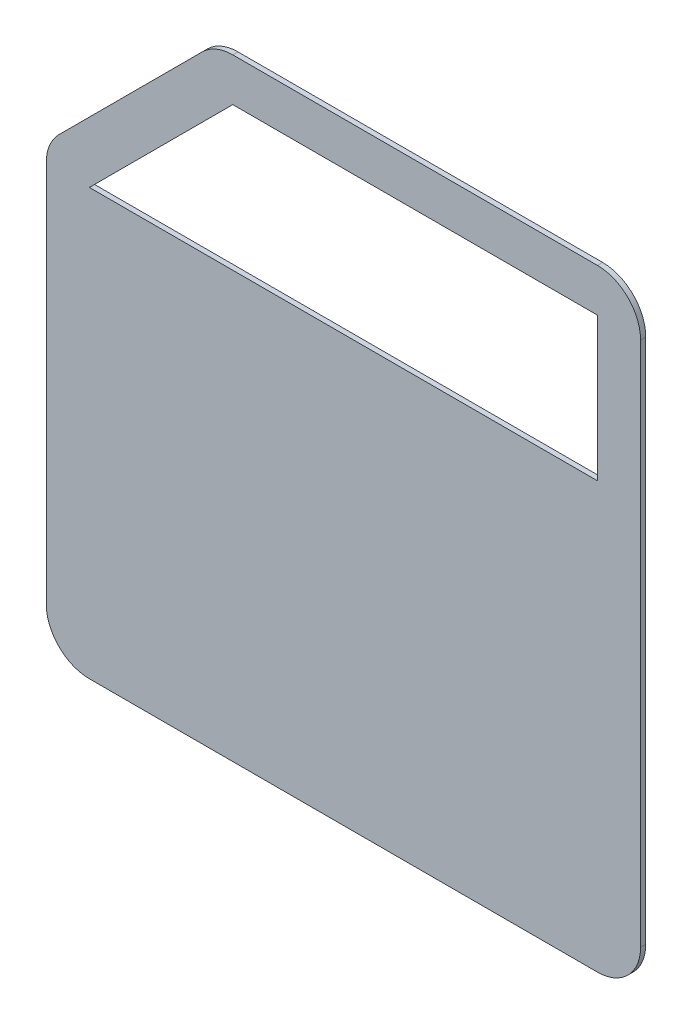
ISO-10303-21;
HEADER;
FILE_DESCRIPTION(('STEP AP214'),'2;1');
FILE_NAME('part.step','',(''),(''),'','','');
FILE_SCHEMA(('AUTOMOTIVE_DESIGN { 1 0 10303 214 1 1 1 1 }'));
ENDSEC;
DATA;
#1=APPLICATION_CONTEXT('core data for automotive mechanical design processes');
#2=APPLICATION_PROTOCOL_DEFINITION('international standard','automotive_design',2000,#1);
#3=PRODUCT_CONTEXT('',#1,'mechanical');
#4=PRODUCT('Part','Part','',(#3));
#5=PRODUCT_RELATED_PRODUCT_CATEGORY('part','',(#4));
#6=PRODUCT_DEFINITION_FORMATION('','',#4);
#7=PRODUCT_DEFINITION_CONTEXT('part definition',#1,'design');
#8=PRODUCT_DEFINITION('design','',#6,#7);
#9=PRODUCT_DEFINITION_SHAPE('','',#8);
#10=(LENGTH_UNIT() NAMED_UNIT(*) SI_UNIT(.MILLI.,.METRE.));
#11=(NAMED_UNIT(*) PLANE_ANGLE_UNIT() SI_UNIT($,.RADIAN.));
#12=(NAMED_UNIT(*) SI_UNIT($,.STERADIAN.) SOLID_ANGLE_UNIT());
#13=UNCERTAINTY_MEASURE_WITH_UNIT(LENGTH_MEASURE(1.E-05),#10,'distance_accuracy_value','');
#14=(GEOMETRIC_REPRESENTATION_CONTEXT(3) GLOBAL_UNCERTAINTY_ASSIGNED_CONTEXT((#13)) GLOBAL_UNIT_ASSIGNED_CONTEXT((#10,
#11,#12)) REPRESENTATION_CONTEXT('',''));
#15=CARTESIAN_POINT('',(0.,0.,0.));
#16=DIRECTION('',(0.,0.,1.));
#17=DIRECTION('',(1.,0.,0.));
#18=AXIS2_PLACEMENT_3D('',#15,#16,#17);
#19=CARTESIAN_POINT('',(711.176734530374,55.,-3.));
#20=DIRECTION('',(0.,0.,1.));
#21=DIRECTION('',(1.,0.,0.));
#22=AXIS2_PLACEMENT_3D('',#19,#20,#21);
#23=CYLINDRICAL_SURFACE('',#22,25.);
#24=CARTESIAN_POINT('',(711.176734530374,55.,0.));
#25=DIRECTION('',(0.,0.,1.));
#26=DIRECTION('',(1.,0.,0.));
#27=AXIS2_PLACEMENT_3D('',#24,#25,#26);
#28=CIRCLE('',#27,25.);
#29=CARTESIAN_POINT('',(711.176734530374,30.,0.));
#30=VERTEX_POINT('',#29);
#31=CARTESIAN_POINT('',(736.176734530374,55.0000000000002,0.));
#32=VERTEX_POINT('',#31);
#33=EDGE_CURVE('E175',#30,#32,#28,.T.);
#34=ORIENTED_EDGE('',*,*,#33,.F.);
#35=DIRECTION('',(0.,0.,1.));
#36=VECTOR('',#35,1.);
#37=CARTESIAN_POINT('',(711.176734530374,30.,-3.));
#38=LINE('',#37,#36);
#39=CARTESIAN_POINT('',(711.176734530374,30.,-3.));
#40=VERTEX_POINT('',#39);
#41=EDGE_CURVE('E11',#40,#30,#38,.T.);
#42=ORIENTED_EDGE('',*,*,#41,.F.);
#43=CARTESIAN_POINT('',(711.176734530374,55.,-3.));
#44=DIRECTION('',(0.,0.,1.));
#45=DIRECTION('',(1.,0.,0.));
#46=AXIS2_PLACEMENT_3D('',#43,#44,#45);
#47=CIRCLE('',#46,25.);
#48=CARTESIAN_POINT('',(736.176734530374,55.0000000000002,-3.));
#49=VERTEX_POINT('',#48);
#50=EDGE_CURVE('E179',#40,#49,#47,.T.);
#51=ORIENTED_EDGE('',*,*,#50,.T.);
#52=DIRECTION('',(0.,0.,1.));
#53=VECTOR('',#52,1.);
#54=CARTESIAN_POINT('',(736.176734530374,55.0000000000002,-3.));
#55=LINE('',#54,#53);
#56=EDGE_CURVE('E44',#49,#32,#55,.T.);
#57=ORIENTED_EDGE('',*,*,#56,.T.);
#58=EDGE_LOOP('',(#34,#42,#51,#57));
#59=FACE_BOUND('',#58,.T.);
#60=ADVANCED_FACE('F41',(#59),#23,.T.);
#61=CARTESIAN_POINT('',(416.466548048329,30.,-3.));
#62=DIRECTION('',(0.,-1.,0.));
#63=DIRECTION('',(1.,0.,0.));
#64=AXIS2_PLACEMENT_3D('',#61,#62,#63);
#65=PLANE('',#64);
#66=DIRECTION('',(1.,0.,0.));
#67=VECTOR('',#66,1.);
#68=CARTESIAN_POINT('',(416.466548048329,30.,0.));
#69=LINE('',#68,#67);
#70=CARTESIAN_POINT('',(416.466548048329,30.,0.));
#71=VERTEX_POINT('',#70);
#72=EDGE_CURVE('E183',#71,#30,#69,.T.);
#73=ORIENTED_EDGE('',*,*,#72,.F.);
#74=DIRECTION('',(0.,0.,1.));
#75=VECTOR('',#74,1.);
#76=CARTESIAN_POINT('',(416.466548048329,30.,-3.));
#77=LINE('',#76,#75);
#78=CARTESIAN_POINT('',(416.466548048329,30.,-3.));
#79=VERTEX_POINT('',#78);
#80=EDGE_CURVE('E49',#79,#71,#77,.T.);
#81=ORIENTED_EDGE('',*,*,#80,.F.);
#82=DIRECTION('',(1.,0.,0.));
#83=VECTOR('',#82,1.);
#84=CARTESIAN_POINT('',(416.466548048329,30.,-3.));
#85=LINE('',#84,#83);
#86=EDGE_CURVE('E207',#79,#40,#85,.T.);
#87=ORIENTED_EDGE('',*,*,#86,.T.);
#88=ORIENTED_EDGE('',*,*,#41,.T.);
#89=EDGE_LOOP('',(#73,#81,#87,#88));
#90=FACE_BOUND('',#89,.T.);
#91=ADVANCED_FACE('F264',(#90),#65,.T.);
#92=CARTESIAN_POINT('',(416.466548048329,55.,-3.));
#93=DIRECTION('',(0.,0.,1.));
#94=DIRECTION('',(1.,0.,0.));
#95=AXIS2_PLACEMENT_3D('',#92,#93,#94);
#96=CYLINDRICAL_SURFACE('',#95,25.);
#97=CARTESIAN_POINT('',(416.466548048329,55.,0.));
#98=DIRECTION('',(0.,0.,1.));
#99=DIRECTION('',(1.,0.,0.));
#100=AXIS2_PLACEMENT_3D('',#97,#98,#99);
#101=CIRCLE('',#100,25.);
#102=CARTESIAN_POINT('',(391.466548048329,55.0000000000002,0.));
#103=VERTEX_POINT('',#102);
#104=EDGE_CURVE('E233',#103,#71,#101,.T.);
#105=ORIENTED_EDGE('',*,*,#104,.F.);
#106=DIRECTION('',(0.,0.,1.));
#107=VECTOR('',#106,1.);
#108=CARTESIAN_POINT('',(391.466548048329,55.0000000000002,-3.));
#109=LINE('',#108,#107);
#110=CARTESIAN_POINT('',(391.466548048329,55.0000000000002,-3.));
#111=VERTEX_POINT('',#110);
#112=EDGE_CURVE('E239',#111,#103,#109,.T.);
#113=ORIENTED_EDGE('',*,*,#112,.F.);
#114=CARTESIAN_POINT('',(416.466548048329,55.,-3.));
#115=DIRECTION('',(0.,0.,1.));
#116=DIRECTION('',(1.,0.,0.));
#117=AXIS2_PLACEMENT_3D('',#114,#115,#116);
#118=CIRCLE('',#117,25.);
#119=EDGE_CURVE('E204',#111,#79,#118,.T.);
#120=ORIENTED_EDGE('',*,*,#119,.T.);
#121=ORIENTED_EDGE('',*,*,#80,.T.);
#122=EDGE_LOOP('',(#105,#113,#120,#121));
#123=FACE_BOUND('',#122,.T.);
#124=ADVANCED_FACE('F291',(#123),#96,.T.);
#125=CARTESIAN_POINT('',(391.466548048329,276.809165979618,-3.));
#126=DIRECTION('',(-1.,0.,0.));
#127=DIRECTION('',(0.,0.,1.));
#128=AXIS2_PLACEMENT_3D('',#125,#126,#127);
#129=PLANE('',#128);
#130=DIRECTION('',(0.,-1.,0.));
#131=VECTOR('',#130,1.);
#132=CARTESIAN_POINT('',(391.466548048329,276.809165979618,0.));
#133=LINE('',#132,#131);
#134=CARTESIAN_POINT('',(391.466548048329,276.809165979618,0.));
#135=VERTEX_POINT('',#134);
#136=EDGE_CURVE('E230',#135,#103,#133,.T.);
#137=ORIENTED_EDGE('',*,*,#136,.F.);
#138=DIRECTION('',(0.,0.,1.));
#139=VECTOR('',#138,1.);
#140=CARTESIAN_POINT('',(391.466548048329,276.809165979618,-3.));
#141=LINE('',#140,#139);
#142=CARTESIAN_POINT('',(391.466548048329,276.809165979618,-3.));
#143=VERTEX_POINT('',#142);
#144=EDGE_CURVE('E241',#143,#135,#141,.T.);
#145=ORIENTED_EDGE('',*,*,#144,.F.);
#146=DIRECTION('',(0.,-1.,0.));
#147=VECTOR('',#146,1.);
#148=CARTESIAN_POINT('',(391.466548048329,276.809165979618,-3.));
#149=LINE('',#148,#147);
#150=EDGE_CURVE('E201',#143,#111,#149,.T.);
#151=ORIENTED_EDGE('',*,*,#150,.T.);
#152=ORIENTED_EDGE('',*,*,#112,.T.);
#153=EDGE_LOOP('',(#137,#145,#151,#152));
#154=FACE_BOUND('',#153,.T.);
#155=ADVANCED_FACE('F289',(#154),#129,.T.);
#156=CARTESIAN_POINT('',(416.466548048329,276.809165979618,-3.));
#157=DIRECTION('',(0.,0.,1.));
#158=DIRECTION('',(1.,0.,0.));
#159=AXIS2_PLACEMENT_3D('',#156,#157,#158);
#160=CYLINDRICAL_SURFACE('',#159,25.);
#161=CARTESIAN_POINT('',(416.466548048329,276.809165979618,0.));
#162=DIRECTION('',(0.,0.,1.));
#163=DIRECTION('',(1.,0.,0.));
#164=AXIS2_PLACEMENT_3D('',#161,#162,#163);
#165=CIRCLE('',#164,25.);
#166=CARTESIAN_POINT('',(398.788878518665,294.486835509282,0.));
#167=VERTEX_POINT('',#166);
#168=EDGE_CURVE('E227',#167,#135,#165,.T.);
#169=ORIENTED_EDGE('',*,*,#168,.F.);
#170=DIRECTION('',(0.,0.,1.));
#171=VECTOR('',#170,1.);
#172=CARTESIAN_POINT('',(398.788878518665,294.486835509282,-3.));
#173=LINE('',#172,#171);
#174=CARTESIAN_POINT('',(398.788878518665,294.486835509282,-3.));
#175=VERTEX_POINT('',#174);
#176=EDGE_CURVE('E243',#175,#167,#173,.T.);
#177=ORIENTED_EDGE('',*,*,#176,.F.);
#178=CARTESIAN_POINT('',(416.466548048329,276.809165979618,-3.));
#179=DIRECTION('',(0.,0.,1.));
#180=DIRECTION('',(1.,0.,0.));
#181=AXIS2_PLACEMENT_3D('',#178,#179,#180);
#182=CIRCLE('',#181,25.);
#183=EDGE_CURVE('E198',#175,#143,#182,.T.);
#184=ORIENTED_EDGE('',*,*,#183,.T.);
#185=ORIENTED_EDGE('',*,*,#144,.T.);
#186=EDGE_LOOP('',(#169,#177,#184,#185));
#187=FACE_BOUND('',#186,.T.);
#188=ADVANCED_FACE('F285',(#187),#160,.T.);
#189=CARTESIAN_POINT('',(481.979712539047,377.677669529664,-3.));
#190=DIRECTION('',(-0.707106781186548,0.707106781186547,0.));
#191=DIRECTION('',(-0.707106781186547,-0.707106781186548,0.));
#192=AXIS2_PLACEMENT_3D('',#189,#190,#191);
#193=PLANE('',#192);
#194=DIRECTION('',(-0.707106781186547,-0.707106781186548,0.));
#195=VECTOR('',#194,1.);
#196=CARTESIAN_POINT('',(481.979712539047,377.677669529664,0.));
#197=LINE('',#196,#195);
#198=CARTESIAN_POINT('',(481.979712539047,377.677669529664,0.));
#199=VERTEX_POINT('',#198);
#200=EDGE_CURVE('E224',#199,#167,#197,.T.);
#201=ORIENTED_EDGE('',*,*,#200,.F.);
#202=DIRECTION('',(0.,0.,1.));
#203=VECTOR('',#202,1.);
#204=CARTESIAN_POINT('',(481.979712539047,377.677669529664,-3.));
#205=LINE('',#204,#203);
#206=CARTESIAN_POINT('',(481.979712539047,377.677669529664,-3.));
#207=VERTEX_POINT('',#206);
#208=EDGE_CURVE('E245',#207,#199,#205,.T.);
#209=ORIENTED_EDGE('',*,*,#208,.F.);
#210=DIRECTION('',(-0.707106781186547,-0.707106781186548,0.));
#211=VECTOR('',#210,1.);
#212=CARTESIAN_POINT('',(481.979712539047,377.677669529664,-3.));
#213=LINE('',#212,#211);
#214=EDGE_CURVE('E195',#207,#175,#213,.T.);
#215=ORIENTED_EDGE('',*,*,#214,.T.);
#216=ORIENTED_EDGE('',*,*,#176,.T.);
#217=EDGE_LOOP('',(#201,#209,#215,#216));
#218=FACE_BOUND('',#217,.T.);
#219=ADVANCED_FACE('F281',(#218),#193,.T.);
#220=CARTESIAN_POINT('',(499.657382068711,360.,-3.));
#221=DIRECTION('',(0.,0.,1.));
#222=DIRECTION('',(1.,0.,0.));
#223=AXIS2_PLACEMENT_3D('',#220,#221,#222);
#224=CYLINDRICAL_SURFACE('',#223,25.);
#225=CARTESIAN_POINT('',(499.657382068711,360.,0.));
#226=DIRECTION('',(0.,0.,1.));
#227=DIRECTION('',(1.,0.,0.));
#228=AXIS2_PLACEMENT_3D('',#225,#226,#227);
#229=CIRCLE('',#228,25.);
#230=CARTESIAN_POINT('',(499.657382068711,385.,0.));
#231=VERTEX_POINT('',#230);
#232=EDGE_CURVE('E221',#231,#199,#229,.T.);
#233=ORIENTED_EDGE('',*,*,#232,.F.);
#234=DIRECTION('',(0.,0.,1.));
#235=VECTOR('',#234,1.);
#236=CARTESIAN_POINT('',(499.657382068711,385.,-3.));
#237=LINE('',#236,#235);
#238=CARTESIAN_POINT('',(499.657382068711,385.,-3.));
#239=VERTEX_POINT('',#238);
#240=EDGE_CURVE('E247',#239,#231,#237,.T.);
#241=ORIENTED_EDGE('',*,*,#240,.F.);
#242=CARTESIAN_POINT('',(499.657382068711,360.,-3.));
#243=DIRECTION('',(0.,0.,1.));
#244=DIRECTION('',(1.,0.,0.));
#245=AXIS2_PLACEMENT_3D('',#242,#243,#244);
#246=CIRCLE('',#245,25.);
#247=EDGE_CURVE('E192',#239,#207,#246,.T.);
#248=ORIENTED_EDGE('',*,*,#247,.T.);
#249=ORIENTED_EDGE('',*,*,#208,.T.);
#250=EDGE_LOOP('',(#233,#241,#248,#249));
#251=FACE_BOUND('',#250,.T.);
#252=ADVANCED_FACE('F277',(#251),#224,.T.);
#253=CARTESIAN_POINT('',(711.176734530374,385.,-3.));
#254=DIRECTION('',(0.,1.,0.));
#255=DIRECTION('',(-1.,0.,0.));
#256=AXIS2_PLACEMENT_3D('',#253,#254,#255);
#257=PLANE('',#256);
#258=DIRECTION('',(-1.,0.,0.));
#259=VECTOR('',#258,1.);
#260=CARTESIAN_POINT('',(711.176734530374,385.,0.));
#261=LINE('',#260,#259);
#262=CARTESIAN_POINT('',(711.176734530374,385.,0.));
#263=VERTEX_POINT('',#262);
#264=EDGE_CURVE('E218',#263,#231,#261,.T.);
#265=ORIENTED_EDGE('',*,*,#264,.F.);
#266=DIRECTION('',(0.,0.,1.));
#267=VECTOR('',#266,1.);
#268=CARTESIAN_POINT('',(711.176734530374,385.,-3.));
#269=LINE('',#268,#267);
#270=CARTESIAN_POINT('',(711.176734530374,385.,-3.));
#271=VERTEX_POINT('',#270);
#272=EDGE_CURVE('E249',#271,#263,#269,.T.);
#273=ORIENTED_EDGE('',*,*,#272,.F.);
#274=DIRECTION('',(-1.,0.,0.));
#275=VECTOR('',#274,1.);
#276=CARTESIAN_POINT('',(711.176734530374,385.,-3.));
#277=LINE('',#276,#275);
#278=EDGE_CURVE('E189',#271,#239,#277,.T.);
#279=ORIENTED_EDGE('',*,*,#278,.T.);
#280=ORIENTED_EDGE('',*,*,#240,.T.);
#281=EDGE_LOOP('',(#265,#273,#279,#280));
#282=FACE_BOUND('',#281,.T.);
#283=ADVANCED_FACE('F275',(#282),#257,.T.);
#284=CARTESIAN_POINT('',(711.176734530374,360.,-3.));
#285=DIRECTION('',(0.,0.,1.));
#286=DIRECTION('',(1.,0.,0.));
#287=AXIS2_PLACEMENT_3D('',#284,#285,#286);
#288=CYLINDRICAL_SURFACE('',#287,25.);
#289=CARTESIAN_POINT('',(711.176734530374,360.,0.));
#290=DIRECTION('',(0.,0.,1.));
#291=DIRECTION('',(1.,0.,0.));
#292=AXIS2_PLACEMENT_3D('',#289,#290,#291);
#293=CIRCLE('',#292,25.);
#294=CARTESIAN_POINT('',(736.176734530374,360.,0.));
#295=VERTEX_POINT('',#294);
#296=EDGE_CURVE('E215',#295,#263,#293,.T.);
#297=ORIENTED_EDGE('',*,*,#296,.F.);
#298=DIRECTION('',(0.,0.,1.));
#299=VECTOR('',#298,1.);
#300=CARTESIAN_POINT('',(736.176734530374,360.,-3.));
#301=LINE('',#300,#299);
#302=CARTESIAN_POINT('',(736.176734530374,360.,-3.));
#303=VERTEX_POINT('',#302);
#304=EDGE_CURVE('E250',#303,#295,#301,.T.);
#305=ORIENTED_EDGE('',*,*,#304,.F.);
#306=CARTESIAN_POINT('',(711.176734530374,360.,-3.));
#307=DIRECTION('',(0.,0.,1.));
#308=DIRECTION('',(1.,0.,0.));
#309=AXIS2_PLACEMENT_3D('',#306,#307,#308);
#310=CIRCLE('',#309,25.);
#311=EDGE_CURVE('E186',#303,#271,#310,.T.);
#312=ORIENTED_EDGE('',*,*,#311,.T.);
#313=ORIENTED_EDGE('',*,*,#272,.T.);
#314=EDGE_LOOP('',(#297,#305,#312,#313));
#315=FACE_BOUND('',#314,.T.);
#316=ADVANCED_FACE('F271',(#315),#288,.T.);
#317=CARTESIAN_POINT('',(736.176734530374,55.0000000000002,-3.));
#318=DIRECTION('',(1.,0.,0.));
#319=DIRECTION('',(0.,0.,-1.));
#320=AXIS2_PLACEMENT_3D('',#317,#318,#319);
#321=PLANE('',#320);
#322=DIRECTION('',(0.,1.,0.));
#323=VECTOR('',#322,1.);
#324=CARTESIAN_POINT('',(736.176734530374,55.0000000000002,0.));
#325=LINE('',#324,#323);
#326=EDGE_CURVE('E212',#32,#295,#325,.T.);
#327=ORIENTED_EDGE('',*,*,#326,.F.);
#328=ORIENTED_EDGE('',*,*,#56,.F.);
#329=DIRECTION('',(0.,1.,0.));
#330=VECTOR('',#329,1.);
#331=CARTESIAN_POINT('',(736.176734530374,55.0000000000002,-3.));
#332=LINE('',#331,#330);
#333=EDGE_CURVE('E182',#49,#303,#332,.T.);
#334=ORIENTED_EDGE('',*,*,#333,.T.);
#335=ORIENTED_EDGE('',*,*,#304,.T.);
#336=EDGE_LOOP('',(#327,#328,#334,#335));
#337=FACE_BOUND('',#336,.T.);
#338=ADVANCED_FACE('F258',(#337),#321,.T.);
#339=CARTESIAN_POINT('',(711.176734530374,55.,-3.));
#340=DIRECTION('',(0.,0.,1.));
#341=DIRECTION('',(1.,0.,0.));
#342=AXIS2_PLACEMENT_3D('',#339,#340,#341);
#343=PLANE('',#342);
#344=DIRECTION('',(-0.707106781186547,-0.707106781186548,0.));
#345=VECTOR('',#344,1.);
#346=CARTESIAN_POINT('',(416.466548048329,276.809165979618,-3.));
#347=LINE('',#346,#345);
#348=CARTESIAN_POINT('',(499.657382068711,360.,-3.));
#349=VERTEX_POINT('',#348);
#350=CARTESIAN_POINT('',(416.466548048329,276.809165979618,-3.));
#351=VERTEX_POINT('',#350);
#352=EDGE_CURVE('E150',#349,#351,#347,.T.);
#353=ORIENTED_EDGE('',*,*,#352,.T.);
#354=DIRECTION('',(1.,0.,0.));
#355=VECTOR('',#354,1.);
#356=CARTESIAN_POINT('',(711.176734530374,276.809165979618,-3.));
#357=LINE('',#356,#355);
#358=CARTESIAN_POINT('',(711.176734530374,276.809165979618,-3.));
#359=VERTEX_POINT('',#358);
#360=EDGE_CURVE('E144',#351,#359,#357,.T.);
#361=ORIENTED_EDGE('',*,*,#360,.T.);
#362=DIRECTION('',(0.,1.,0.));
#363=VECTOR('',#362,1.);
#364=CARTESIAN_POINT('',(711.176734530374,360.,-3.));
#365=LINE('',#364,#363);
#366=CARTESIAN_POINT('',(711.176734530374,360.,-3.));
#367=VERTEX_POINT('',#366);
#368=EDGE_CURVE('E153',#359,#367,#365,.T.);
#369=ORIENTED_EDGE('',*,*,#368,.T.);
#370=DIRECTION('',(-1.,0.,0.));
#371=VECTOR('',#370,1.);
#372=CARTESIAN_POINT('',(499.657382068711,360.,-3.));
#373=LINE('',#372,#371);
#374=EDGE_CURVE('E57',#367,#349,#373,.T.);
#375=ORIENTED_EDGE('',*,*,#374,.T.);
#376=EDGE_LOOP('',(#353,#361,#369,#375));
#377=FACE_BOUND('',#376,.T.);
#378=ORIENTED_EDGE('',*,*,#50,.F.);
#379=ORIENTED_EDGE('',*,*,#86,.F.);
#380=ORIENTED_EDGE('',*,*,#119,.F.);
#381=ORIENTED_EDGE('',*,*,#150,.F.);
#382=ORIENTED_EDGE('',*,*,#183,.F.);
#383=ORIENTED_EDGE('',*,*,#214,.F.);
#384=ORIENTED_EDGE('',*,*,#247,.F.);
#385=ORIENTED_EDGE('',*,*,#278,.F.);
#386=ORIENTED_EDGE('',*,*,#311,.F.);
#387=ORIENTED_EDGE('',*,*,#333,.F.);
#388=EDGE_LOOP('',(#378,#379,#380,#381,#382,#383,#384,#385,#386,#387));
#389=FACE_BOUND('',#388,.T.);
#390=ADVANCED_FACE('F157',(#377,#389),#343,.F.);
#391=CARTESIAN_POINT('',(711.176734530374,55.,0.));
#392=DIRECTION('',(0.,0.,1.));
#393=DIRECTION('',(1.,0.,0.));
#394=AXIS2_PLACEMENT_3D('',#391,#392,#393);
#395=PLANE('',#394);
#396=DIRECTION('',(1.,0.,0.));
#397=VECTOR('',#396,1.);
#398=CARTESIAN_POINT('',(711.176734530374,276.809165979618,0.));
#399=LINE('',#398,#397);
#400=CARTESIAN_POINT('',(416.466548048329,276.809165979618,0.));
#401=VERTEX_POINT('',#400);
#402=CARTESIAN_POINT('',(711.176734530374,276.809165979618,0.));
#403=VERTEX_POINT('',#402);
#404=EDGE_CURVE('E65',#401,#403,#399,.T.);
#405=ORIENTED_EDGE('',*,*,#404,.F.);
#406=DIRECTION('',(-0.707106781186547,-0.707106781186548,0.));
#407=VECTOR('',#406,1.);
#408=CARTESIAN_POINT('',(416.466548048329,276.809165979618,0.));
#409=LINE('',#408,#407);
#410=CARTESIAN_POINT('',(499.657382068711,360.,0.));
#411=VERTEX_POINT('',#410);
#412=EDGE_CURVE('E160',#411,#401,#409,.T.);
#413=ORIENTED_EDGE('',*,*,#412,.F.);
#414=DIRECTION('',(-1.,0.,0.));
#415=VECTOR('',#414,1.);
#416=CARTESIAN_POINT('',(499.657382068711,360.,0.));
#417=LINE('',#416,#415);
#418=CARTESIAN_POINT('',(711.176734530374,360.,0.));
#419=VERTEX_POINT('',#418);
#420=EDGE_CURVE('E163',#419,#411,#417,.T.);
#421=ORIENTED_EDGE('',*,*,#420,.F.);
#422=DIRECTION('',(0.,1.,0.));
#423=VECTOR('',#422,1.);
#424=CARTESIAN_POINT('',(711.176734530374,360.,0.));
#425=LINE('',#424,#423);
#426=EDGE_CURVE('E169',#403,#419,#425,.T.);
#427=ORIENTED_EDGE('',*,*,#426,.F.);
#428=EDGE_LOOP('',(#405,#413,#421,#427));
#429=FACE_BOUND('',#428,.T.);
#430=ORIENTED_EDGE('',*,*,#33,.T.);
#431=ORIENTED_EDGE('',*,*,#326,.T.);
#432=ORIENTED_EDGE('',*,*,#296,.T.);
#433=ORIENTED_EDGE('',*,*,#264,.T.);
#434=ORIENTED_EDGE('',*,*,#232,.T.);
#435=ORIENTED_EDGE('',*,*,#200,.T.);
#436=ORIENTED_EDGE('',*,*,#168,.T.);
#437=ORIENTED_EDGE('',*,*,#136,.T.);
#438=ORIENTED_EDGE('',*,*,#104,.T.);
#439=ORIENTED_EDGE('',*,*,#72,.T.);
#440=EDGE_LOOP('',(#430,#431,#432,#433,#434,#435,#436,#437,#438,#439));
#441=FACE_BOUND('',#440,.T.);
#442=ADVANCED_FACE('F260',(#429,#441),#395,.T.);
#443=CARTESIAN_POINT('',(711.176734530374,276.809165979618,-3.));
#444=DIRECTION('',(0.,-1.,0.));
#445=DIRECTION('',(0.,0.,-1.));
#446=AXIS2_PLACEMENT_3D('',#443,#444,#445);
#447=PLANE('',#446);
#448=ORIENTED_EDGE('',*,*,#404,.T.);
#449=DIRECTION('',(0.,0.,1.));
#450=VECTOR('',#449,1.);
#451=CARTESIAN_POINT('',(711.176734530374,276.809165979618,-3.));
#452=LINE('',#451,#450);
#453=EDGE_CURVE('E140',#359,#403,#452,.T.);
#454=ORIENTED_EDGE('',*,*,#453,.F.);
#455=ORIENTED_EDGE('',*,*,#360,.F.);
#456=DIRECTION('',(0.,0.,1.));
#457=VECTOR('',#456,1.);
#458=CARTESIAN_POINT('',(416.466548048329,276.809165979618,-3.));
#459=LINE('',#458,#457);
#460=EDGE_CURVE('E173',#351,#401,#459,.T.);
#461=ORIENTED_EDGE('',*,*,#460,.T.);
#462=EDGE_LOOP('',(#448,#454,#455,#461));
#463=FACE_BOUND('',#462,.T.);
#464=ADVANCED_FACE('F142',(#463),#447,.F.);
#465=CARTESIAN_POINT('',(416.466548048329,276.809165979618,-3.));
#466=DIRECTION('',(-0.707106781186548,0.707106781186547,0.));
#467=DIRECTION('',(-0.707106781186547,-0.707106781186548,0.));
#468=AXIS2_PLACEMENT_3D('',#465,#466,#467);
#469=PLANE('',#468);
#470=ORIENTED_EDGE('',*,*,#412,.T.);
#471=ORIENTED_EDGE('',*,*,#460,.F.);
#472=ORIENTED_EDGE('',*,*,#352,.F.);
#473=DIRECTION('',(0.,0.,1.));
#474=VECTOR('',#473,1.);
#475=CARTESIAN_POINT('',(499.657382068711,360.,-3.));
#476=LINE('',#475,#474);
#477=EDGE_CURVE('E176',#349,#411,#476,.T.);
#478=ORIENTED_EDGE('',*,*,#477,.T.);
#479=EDGE_LOOP('',(#470,#471,#472,#478));
#480=FACE_BOUND('',#479,.T.);
#481=ADVANCED_FACE('F391',(#480),#469,.F.);
#482=CARTESIAN_POINT('',(499.657382068711,360.,-3.));
#483=DIRECTION('',(0.,1.,0.));
#484=DIRECTION('',(-1.,0.,0.));
#485=AXIS2_PLACEMENT_3D('',#482,#483,#484);
#486=PLANE('',#485);
#487=ORIENTED_EDGE('',*,*,#420,.T.);
#488=ORIENTED_EDGE('',*,*,#477,.F.);
#489=ORIENTED_EDGE('',*,*,#374,.F.);
#490=DIRECTION('',(0.,0.,1.));
#491=VECTOR('',#490,1.);
#492=CARTESIAN_POINT('',(711.176734530374,360.,-3.));
#493=LINE('',#492,#491);
#494=EDGE_CURVE('E149',#367,#419,#493,.T.);
#495=ORIENTED_EDGE('',*,*,#494,.T.);
#496=EDGE_LOOP('',(#487,#488,#489,#495));
#497=FACE_BOUND('',#496,.T.);
#498=ADVANCED_FACE('F400',(#497),#486,.F.);
#499=CARTESIAN_POINT('',(711.176734530374,360.,-3.));
#500=DIRECTION('',(1.,0.,0.));
#501=DIRECTION('',(0.,0.,-1.));
#502=AXIS2_PLACEMENT_3D('',#499,#500,#501);
#503=PLANE('',#502);
#504=ORIENTED_EDGE('',*,*,#426,.T.);
#505=ORIENTED_EDGE('',*,*,#494,.F.);
#506=ORIENTED_EDGE('',*,*,#368,.F.);
#507=ORIENTED_EDGE('',*,*,#453,.T.);
#508=EDGE_LOOP('',(#504,#505,#506,#507));
#509=FACE_BOUND('',#508,.T.);
#510=ADVANCED_FACE('F154',(#509),#503,.F.);
#511=CLOSED_SHELL('',(#60,#91,#124,#155,#188,#219,#252,#283,#316,#338,#390,#442,#464,#481,#498,#510));
#512=MANIFOLD_SOLID_BREP('B2',#511);
#513=ADVANCED_BREP_SHAPE_REPRESENTATION('',(#18,#512),#14);
#514=SHAPE_DEFINITION_REPRESENTATION(#9,#513);
ENDSEC;
END-ISO-10303-21;
